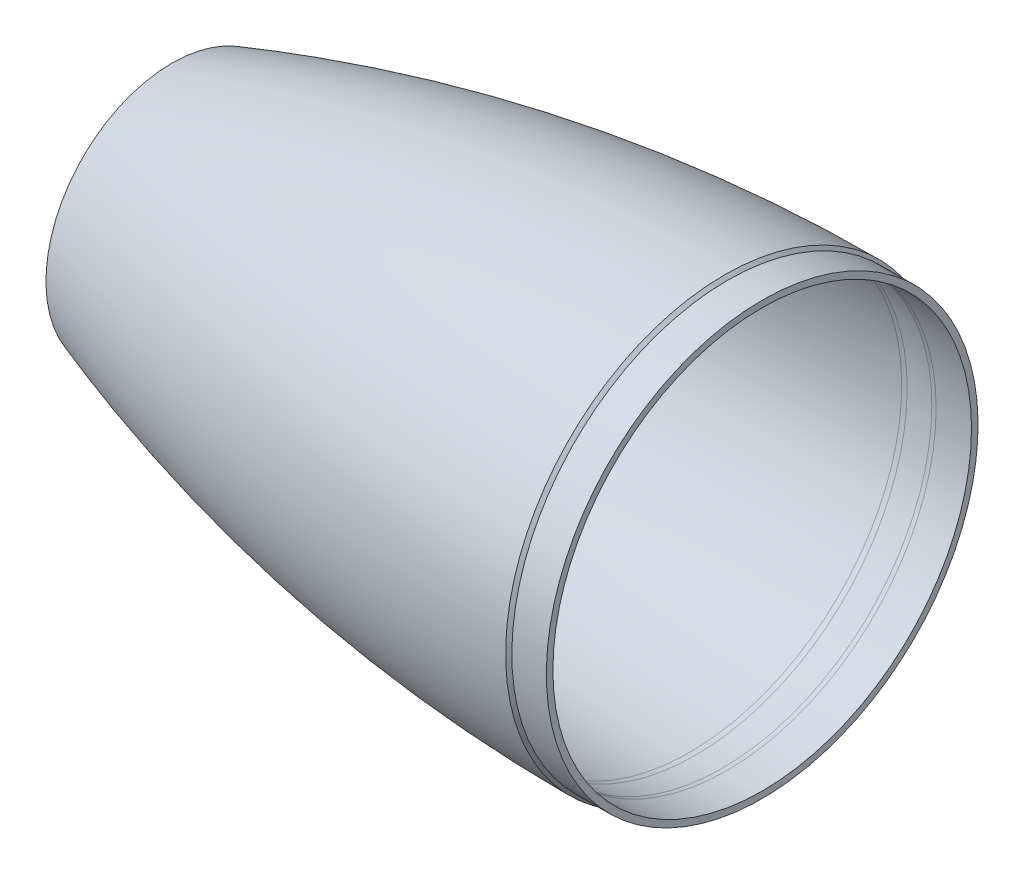
ISO-10303-21;
HEADER;
FILE_DESCRIPTION(('STEP AP214'),'2;1');
FILE_NAME('part.step','',(''),(''),'','','');
FILE_SCHEMA(('AUTOMOTIVE_DESIGN { 1 0 10303 214 1 1 1 1 }'));
ENDSEC;
DATA;
#1=APPLICATION_CONTEXT('core data for automotive mechanical design processes');
#2=APPLICATION_PROTOCOL_DEFINITION('international standard','automotive_design',2000,#1);
#3=PRODUCT_CONTEXT('',#1,'mechanical');
#4=PRODUCT('Part','Part','',(#3));
#5=PRODUCT_RELATED_PRODUCT_CATEGORY('part','',(#4));
#6=PRODUCT_DEFINITION_FORMATION('','',#4);
#7=PRODUCT_DEFINITION_CONTEXT('part definition',#1,'design');
#8=PRODUCT_DEFINITION('design','',#6,#7);
#9=PRODUCT_DEFINITION_SHAPE('','',#8);
#10=(LENGTH_UNIT() NAMED_UNIT(*) SI_UNIT(.MILLI.,.METRE.));
#11=(NAMED_UNIT(*) PLANE_ANGLE_UNIT() SI_UNIT($,.RADIAN.));
#12=(NAMED_UNIT(*) SI_UNIT($,.STERADIAN.) SOLID_ANGLE_UNIT());
#13=UNCERTAINTY_MEASURE_WITH_UNIT(LENGTH_MEASURE(1.E-05),#10,'distance_accuracy_value','');
#14=(GEOMETRIC_REPRESENTATION_CONTEXT(3) GLOBAL_UNCERTAINTY_ASSIGNED_CONTEXT((#13)) GLOBAL_UNIT_ASSIGNED_CONTEXT((#10,
#11,#12)) REPRESENTATION_CONTEXT('',''));
#15=CARTESIAN_POINT('',(0.,0.,0.));
#16=DIRECTION('',(0.,0.,1.));
#17=DIRECTION('',(1.,0.,0.));
#18=AXIS2_PLACEMENT_3D('',#15,#16,#17);
#19=CARTESIAN_POINT('',(-1.32216495746667E-13,0.,0.));
#20=DIRECTION('',(1.,0.,0.));
#21=DIRECTION('',(0.,1.,0.));
#22=AXIS2_PLACEMENT_3D('',#19,#20,#21);
#23=DEGENERATE_TOROIDAL_SURFACE('',#22,540.875767657992,621.393767657992,.F.);
#24=CARTESIAN_POINT('',(-203.2,0.,0.));
#25=DIRECTION('',(1.,0.,0.));
#26=DIRECTION('',(0.,1.,0.));
#27=AXIS2_PLACEMENT_3D('',#24,#25,#26);
#28=CIRCLE('',#27,46.355);
#29=CARTESIAN_POINT('',(-203.2,46.355,0.));
#30=VERTEX_POINT('',#29);
#31=EDGE_CURVE('E10',#30,#30,#28,.T.);
#32=ORIENTED_EDGE('',*,*,#31,.T.);
#33=EDGE_LOOP('',(#32));
#34=FACE_BOUND('',#33,.T.);
#35=CARTESIAN_POINT('',(0.,0.,0.));
#36=DIRECTION('',(1.,0.,0.));
#37=DIRECTION('',(0.,1.,0.));
#38=AXIS2_PLACEMENT_3D('',#35,#36,#37);
#39=CIRCLE('',#38,80.518);
#40=CARTESIAN_POINT('',(0.,80.518,0.));
#41=VERTEX_POINT('',#40);
#42=EDGE_CURVE('E81',#41,#41,#39,.T.);
#43=ORIENTED_EDGE('',*,*,#42,.F.);
#44=EDGE_LOOP('',(#43));
#45=FACE_BOUND('',#44,.T.);
#46=ADVANCED_FACE('F35',(#34,#45),#23,.F.);
#47=CARTESIAN_POINT('',(-203.2,46.355,0.));
#48=DIRECTION('',(-1.,0.,0.));
#49=DIRECTION('',(0.,-1.,0.));
#50=AXIS2_PLACEMENT_3D('',#47,#48,#49);
#51=PLANE('',#50);
#52=CARTESIAN_POINT('',(-203.2,0.,0.));
#53=DIRECTION('',(1.,0.,0.));
#54=DIRECTION('',(0.,1.,0.));
#55=AXIS2_PLACEMENT_3D('',#52,#53,#54);
#56=CIRCLE('',#55,41.4655);
#57=CARTESIAN_POINT('',(-203.2,41.4655,0.));
#58=VERTEX_POINT('',#57);
#59=EDGE_CURVE('E41',#58,#58,#56,.T.);
#60=ORIENTED_EDGE('',*,*,#59,.T.);
#61=EDGE_LOOP('',(#60));
#62=FACE_BOUND('',#61,.T.);
#63=ORIENTED_EDGE('',*,*,#31,.F.);
#64=EDGE_LOOP('',(#63));
#65=FACE_BOUND('',#64,.T.);
#66=ADVANCED_FACE('F89',(#62,#65),#51,.T.);
#67=CARTESIAN_POINT('',(0.,0.,0.));
#68=DIRECTION('',(1.,0.,0.));
#69=DIRECTION('',(0.,1.,0.));
#70=AXIS2_PLACEMENT_3D('',#67,#68,#69);
#71=CYLINDRICAL_SURFACE('',#70,41.4655);
#72=CARTESIAN_POINT('',(-183.754587886012,0.,0.));
#73=DIRECTION('',(1.,0.,0.));
#74=DIRECTION('',(0.,1.,0.));
#75=AXIS2_PLACEMENT_3D('',#72,#73,#74);
#76=CIRCLE('',#75,41.4655);
#77=CARTESIAN_POINT('',(-183.754587886012,41.4655,0.));
#78=VERTEX_POINT('',#77);
#79=EDGE_CURVE('E45',#78,#78,#76,.T.);
#80=ORIENTED_EDGE('',*,*,#79,.T.);
#81=EDGE_LOOP('',(#80));
#82=FACE_BOUND('',#81,.T.);
#83=ORIENTED_EDGE('',*,*,#59,.F.);
#84=EDGE_LOOP('',(#83));
#85=FACE_BOUND('',#84,.T.);
#86=ADVANCED_FACE('F93',(#82,#85),#71,.F.);
#87=CARTESIAN_POINT('',(-183.754587886012,0.,0.));
#88=DIRECTION('',(1.,0.,0.));
#89=DIRECTION('',(0.,1.,0.));
#90=AXIS2_PLACEMENT_3D('',#87,#88,#89);
#91=TOROIDAL_SURFACE('',#90,60.5155,19.05);
#92=CARTESIAN_POINT('',(-172.905421762389,0.,0.));
#93=DIRECTION('',(1.,0.,0.));
#94=DIRECTION('',(0.,1.,0.));
#95=AXIS2_PLACEMENT_3D('',#92,#93,#94);
#96=CIRCLE('',#95,44.8566975418925);
#97=CARTESIAN_POINT('',(-172.905421762389,44.8566975418924,0.));
#98=VERTEX_POINT('',#97);
#99=EDGE_CURVE('E49',#98,#98,#96,.T.);
#100=ORIENTED_EDGE('',*,*,#99,.T.);
#101=EDGE_LOOP('',(#100));
#102=FACE_BOUND('',#101,.T.);
#103=ORIENTED_EDGE('',*,*,#79,.F.);
#104=EDGE_LOOP('',(#103));
#105=FACE_BOUND('',#104,.T.);
#106=ADVANCED_FACE('F97',(#102,#105),#91,.T.);
#107=CARTESIAN_POINT('',(-172.905421762389,0.,0.));
#108=DIRECTION('',(1.,0.,0.));
#109=DIRECTION('',(0.,1.,0.));
#110=AXIS2_PLACEMENT_3D('',#107,#108,#109);
#111=CONICAL_SURFACE('',#110,44.8566975418925,0.605909653481921);
#112=CARTESIAN_POINT('',(-157.174655244386,0.,0.));
#113=DIRECTION('',(1.,0.,0.));
#114=DIRECTION('',(0.,1.,0.));
#115=AXIS2_PLACEMENT_3D('',#112,#113,#114);
#116=CIRCLE('',#115,55.7557238028291);
#117=CARTESIAN_POINT('',(-157.174655244386,55.7557238028291,0.));
#118=VERTEX_POINT('',#117);
#119=EDGE_CURVE('E54',#118,#118,#116,.T.);
#120=ORIENTED_EDGE('',*,*,#119,.T.);
#121=EDGE_LOOP('',(#120));
#122=FACE_BOUND('',#121,.T.);
#123=ORIENTED_EDGE('',*,*,#99,.F.);
#124=EDGE_LOOP('',(#123));
#125=FACE_BOUND('',#124,.T.);
#126=ADVANCED_FACE('F104',(#122,#125),#111,.F.);
#127=CARTESIAN_POINT('',(-139.092711705015,0.,0.));
#128=DIRECTION('',(1.,0.,0.));
#129=DIRECTION('',(0.,1.,0.));
#130=AXIS2_PLACEMENT_3D('',#127,#128,#129);
#131=DEGENERATE_TOROIDAL_SURFACE('',#130,29.6577197059834,31.7499999999998,.T.);
#132=CARTESIAN_POINT('',(-146.612916839327,0.,0.));
#133=DIRECTION('',(1.,0.,0.));
#134=DIRECTION('',(0.,1.,0.));
#135=AXIS2_PLACEMENT_3D('',#132,#133,#134);
#136=CIRCLE('',#135,60.5042594590556);
#137=CARTESIAN_POINT('',(-146.612916839327,60.5042594590556,0.));
#138=VERTEX_POINT('',#137);
#139=EDGE_CURVE('E57',#138,#138,#136,.T.);
#140=ORIENTED_EDGE('',*,*,#139,.T.);
#141=EDGE_LOOP('',(#140));
#142=FACE_BOUND('',#141,.T.);
#143=ORIENTED_EDGE('',*,*,#119,.F.);
#144=EDGE_LOOP('',(#143));
#145=FACE_BOUND('',#144,.T.);
#146=ADVANCED_FACE('F108',(#142,#145),#131,.F.);
#147=CARTESIAN_POINT('',(-1.32216495746667E-13,0.,0.));
#148=DIRECTION('',(1.,0.,0.));
#149=DIRECTION('',(0.,1.,0.));
#150=AXIS2_PLACEMENT_3D('',#147,#148,#149);
#151=DEGENERATE_TOROIDAL_SURFACE('',#150,540.875767657992,618.993767657991,.F.);
#152=CARTESIAN_POINT('',(-12.8199586922017,0.,0.));
#153=DIRECTION('',(1.,0.,0.));
#154=DIRECTION('',(0.,1.,0.));
#155=AXIS2_PLACEMENT_3D('',#152,#153,#154);
#156=CIRCLE('',#155,77.985228898235);
#157=CARTESIAN_POINT('',(-12.8199586922017,77.985228898235,0.));
#158=VERTEX_POINT('',#157);
#159=EDGE_CURVE('E60',#158,#158,#156,.T.);
#160=ORIENTED_EDGE('',*,*,#159,.T.);
#161=EDGE_LOOP('',(#160));
#162=FACE_BOUND('',#161,.T.);
#163=ORIENTED_EDGE('',*,*,#139,.F.);
#164=EDGE_LOOP('',(#163));
#165=FACE_BOUND('',#164,.T.);
#166=ADVANCED_FACE('F112',(#162,#165),#151,.T.);
#167=CARTESIAN_POINT('',(-12.4254147955637,0.,0.));
#168=DIRECTION('',(1.,0.,0.));
#169=DIRECTION('',(0.,1.,0.));
#170=AXIS2_PLACEMENT_3D('',#167,#168,#169);
#171=TOROIDAL_SURFACE('',#170,58.9393150290182,19.05);
#172=CARTESIAN_POINT('',(-10.7650978962209,0.,0.));
#173=DIRECTION('',(1.,0.,0.));
#174=DIRECTION('',(0.,1.,0.));
#175=AXIS2_PLACEMENT_3D('',#172,#173,#174);
#176=CIRCLE('',#175,77.916824027666);
#177=CARTESIAN_POINT('',(-10.7650978962209,77.916824027666,0.));
#178=VERTEX_POINT('',#177);
#179=EDGE_CURVE('E63',#178,#178,#176,.T.);
#180=ORIENTED_EDGE('',*,*,#179,.T.);
#181=EDGE_LOOP('',(#180));
#182=FACE_BOUND('',#181,.T.);
#183=ORIENTED_EDGE('',*,*,#159,.F.);
#184=EDGE_LOOP('',(#183));
#185=FACE_BOUND('',#184,.T.);
#186=ADVANCED_FACE('F116',(#182,#185),#171,.F.);
#187=CARTESIAN_POINT('',(-10.7650978962209,0.,0.));
#188=DIRECTION('',(-1.,0.,0.));
#189=DIRECTION('',(0.,-1.,0.));
#190=AXIS2_PLACEMENT_3D('',#187,#188,#189);
#191=CONICAL_SURFACE('',#190,77.916824027666,0.0872664625997071);
#192=CARTESIAN_POINT('',(-0.828575936935652,0.,0.));
#193=DIRECTION('',(1.,0.,0.));
#194=DIRECTION('',(0.,1.,0.));
#195=AXIS2_PLACEMENT_3D('',#192,#193,#194);
#196=CIRCLE('',#195,77.0474910013522);
#197=CARTESIAN_POINT('',(-0.828575936935662,77.0474910013522,0.));
#198=VERTEX_POINT('',#197);
#199=EDGE_CURVE('E66',#198,#198,#196,.T.);
#200=ORIENTED_EDGE('',*,*,#199,.T.);
#201=EDGE_LOOP('',(#200));
#202=FACE_BOUND('',#201,.T.);
#203=ORIENTED_EDGE('',*,*,#179,.F.);
#204=EDGE_LOOP('',(#203));
#205=FACE_BOUND('',#204,.T.);
#206=ADVANCED_FACE('F120',(#202,#205),#191,.F.);
#207=CARTESIAN_POINT('',(0.831740962407105,0.,0.));
#208=DIRECTION('',(1.,0.,0.));
#209=DIRECTION('',(0.,1.,0.));
#210=AXIS2_PLACEMENT_3D('',#207,#208,#209);
#211=TOROIDAL_SURFACE('',#210,96.025,19.05);
#212=CARTESIAN_POINT('',(0.831740962407103,0.,0.));
#213=DIRECTION('',(1.,0.,0.));
#214=DIRECTION('',(0.,1.,0.));
#215=AXIS2_PLACEMENT_3D('',#212,#213,#214);
#216=CIRCLE('',#215,76.975);
#217=CARTESIAN_POINT('',(0.831740962407094,76.975,0.));
#218=VERTEX_POINT('',#217);
#219=EDGE_CURVE('E69',#218,#218,#216,.T.);
#220=ORIENTED_EDGE('',*,*,#219,.T.);
#221=EDGE_LOOP('',(#220));
#222=FACE_BOUND('',#221,.T.);
#223=ORIENTED_EDGE('',*,*,#199,.F.);
#224=EDGE_LOOP('',(#223));
#225=FACE_BOUND('',#224,.T.);
#226=ADVANCED_FACE('F124',(#222,#225),#211,.T.);
#227=CARTESIAN_POINT('',(0.,0.,0.));
#228=DIRECTION('',(1.,0.,0.));
#229=DIRECTION('',(0.,1.,0.));
#230=AXIS2_PLACEMENT_3D('',#227,#228,#229);
#231=CYLINDRICAL_SURFACE('',#230,76.975);
#232=CARTESIAN_POINT('',(13.8429999999995,0.,0.));
#233=DIRECTION('',(1.,0.,0.));
#234=DIRECTION('',(0.,1.,0.));
#235=AXIS2_PLACEMENT_3D('',#232,#233,#234);
#236=CIRCLE('',#235,76.975);
#237=CARTESIAN_POINT('',(13.8429999999995,76.975,0.));
#238=VERTEX_POINT('',#237);
#239=EDGE_CURVE('E72',#238,#238,#236,.T.);
#240=ORIENTED_EDGE('',*,*,#239,.T.);
#241=EDGE_LOOP('',(#240));
#242=FACE_BOUND('',#241,.T.);
#243=ORIENTED_EDGE('',*,*,#219,.F.);
#244=EDGE_LOOP('',(#243));
#245=FACE_BOUND('',#244,.T.);
#246=ADVANCED_FACE('F128',(#242,#245),#231,.F.);
#247=CARTESIAN_POINT('',(13.8429999999996,76.975,0.));
#248=DIRECTION('',(1.,0.,0.));
#249=DIRECTION('',(0.,1.,0.));
#250=AXIS2_PLACEMENT_3D('',#247,#248,#249);
#251=PLANE('',#250);
#252=CARTESIAN_POINT('',(13.8429999999996,0.,0.));
#253=DIRECTION('',(1.,0.,0.));
#254=DIRECTION('',(0.,1.,0.));
#255=AXIS2_PLACEMENT_3D('',#252,#253,#254);
#256=CIRCLE('',#255,79.375);
#257=CARTESIAN_POINT('',(13.8429999999996,79.375,0.));
#258=VERTEX_POINT('',#257);
#259=EDGE_CURVE('E75',#258,#258,#256,.T.);
#260=ORIENTED_EDGE('',*,*,#259,.T.);
#261=EDGE_LOOP('',(#260));
#262=FACE_BOUND('',#261,.T.);
#263=ORIENTED_EDGE('',*,*,#239,.F.);
#264=EDGE_LOOP('',(#263));
#265=FACE_BOUND('',#264,.T.);
#266=ADVANCED_FACE('F132',(#262,#265),#251,.T.);
#267=CARTESIAN_POINT('',(0.,0.,0.));
#268=DIRECTION('',(1.,0.,0.));
#269=DIRECTION('',(0.,1.,0.));
#270=AXIS2_PLACEMENT_3D('',#267,#268,#269);
#271=CYLINDRICAL_SURFACE('',#270,79.375);
#272=CARTESIAN_POINT('',(1.1429999999996,0.,0.));
#273=DIRECTION('',(1.,0.,0.));
#274=DIRECTION('',(0.,1.,0.));
#275=AXIS2_PLACEMENT_3D('',#272,#273,#274);
#276=CIRCLE('',#275,79.375);
#277=CARTESIAN_POINT('',(1.14299999999959,79.375,0.));
#278=VERTEX_POINT('',#277);
#279=EDGE_CURVE('E78',#278,#278,#276,.T.);
#280=ORIENTED_EDGE('',*,*,#279,.T.);
#281=EDGE_LOOP('',(#280));
#282=FACE_BOUND('',#281,.T.);
#283=ORIENTED_EDGE('',*,*,#259,.F.);
#284=EDGE_LOOP('',(#283));
#285=FACE_BOUND('',#284,.T.);
#286=ADVANCED_FACE('F136',(#282,#285),#271,.T.);
#287=CARTESIAN_POINT('',(1.1429999999996,0.,0.));
#288=DIRECTION('',(-1.,0.,0.));
#289=DIRECTION('',(0.,-1.,0.));
#290=AXIS2_PLACEMENT_3D('',#287,#288,#289);
#291=CONICAL_SURFACE('',#290,79.375,0.785398163397619);
#292=ORIENTED_EDGE('',*,*,#42,.T.);
#293=EDGE_LOOP('',(#292));
#294=FACE_BOUND('',#293,.T.);
#295=ORIENTED_EDGE('',*,*,#279,.F.);
#296=EDGE_LOOP('',(#295));
#297=FACE_BOUND('',#296,.T.);
#298=ADVANCED_FACE('F85',(#294,#297),#291,.T.);
#299=CLOSED_SHELL('',(#46,#66,#86,#106,#126,#146,#166,#186,#206,#226,#246,#266,#286,#298));
#300=MANIFOLD_SOLID_BREP('B2',#299);
#301=ADVANCED_BREP_SHAPE_REPRESENTATION('',(#18,#300),#14);
#302=SHAPE_DEFINITION_REPRESENTATION(#9,#301);
ENDSEC;
END-ISO-10303-21;
